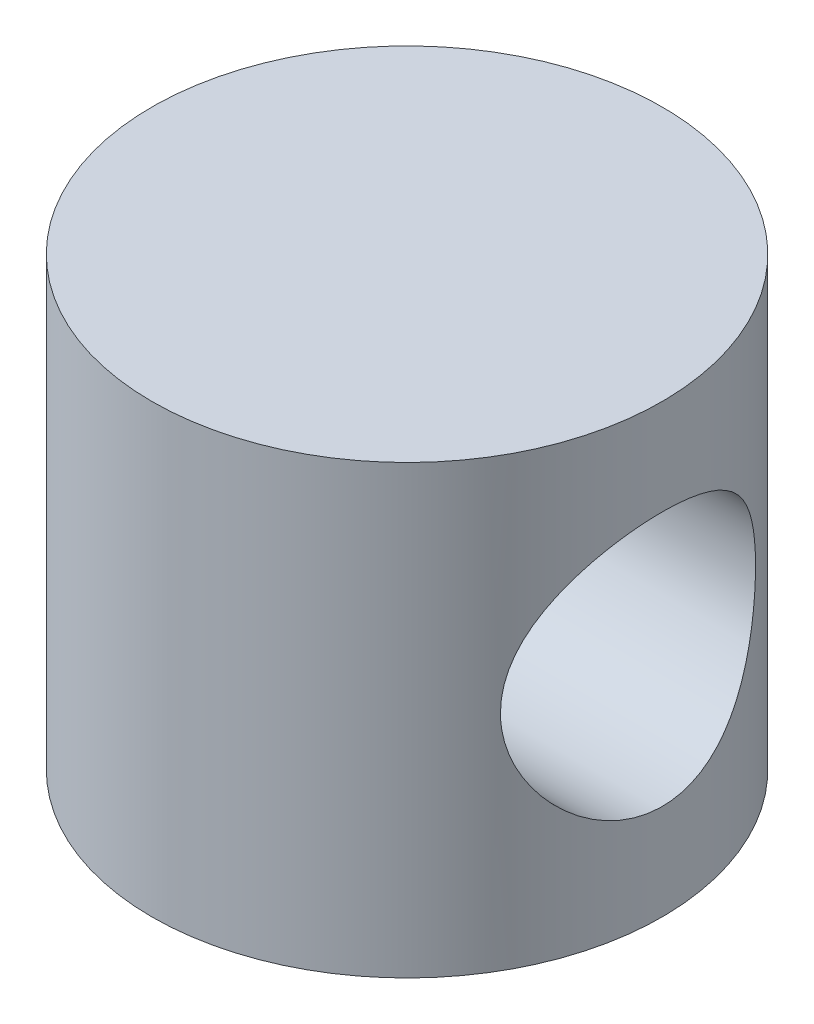
ISO-10303-21;
HEADER;
FILE_DESCRIPTION(('STEP AP214'),'2;1');
FILE_NAME('part.step','',(''),(''),'','','');
FILE_SCHEMA(('AUTOMOTIVE_DESIGN { 1 0 10303 214 1 1 1 1 }'));
ENDSEC;
DATA;
#1=APPLICATION_CONTEXT('core data for automotive mechanical design processes');
#2=APPLICATION_PROTOCOL_DEFINITION('international standard','automotive_design',2000,#1);
#3=PRODUCT_CONTEXT('',#1,'mechanical');
#4=PRODUCT('Part','Part','',(#3));
#5=PRODUCT_RELATED_PRODUCT_CATEGORY('part','',(#4));
#6=PRODUCT_DEFINITION_FORMATION('','',#4);
#7=PRODUCT_DEFINITION_CONTEXT('part definition',#1,'design');
#8=PRODUCT_DEFINITION('design','',#6,#7);
#9=PRODUCT_DEFINITION_SHAPE('','',#8);
#10=(LENGTH_UNIT() NAMED_UNIT(*) SI_UNIT(.MILLI.,.METRE.));
#11=(NAMED_UNIT(*) PLANE_ANGLE_UNIT() SI_UNIT($,.RADIAN.));
#12=(NAMED_UNIT(*) SI_UNIT($,.STERADIAN.) SOLID_ANGLE_UNIT());
#13=UNCERTAINTY_MEASURE_WITH_UNIT(LENGTH_MEASURE(1.E-05),#10,'distance_accuracy_value','');
#14=(GEOMETRIC_REPRESENTATION_CONTEXT(3) GLOBAL_UNCERTAINTY_ASSIGNED_CONTEXT((#13)) GLOBAL_UNIT_ASSIGNED_CONTEXT((#10,
#11,#12)) REPRESENTATION_CONTEXT('',''));
#15=CARTESIAN_POINT('',(0.,0.,0.));
#16=DIRECTION('',(0.,0.,1.));
#17=DIRECTION('',(1.,0.,0.));
#18=AXIS2_PLACEMENT_3D('',#15,#16,#17);
#19=CARTESIAN_POINT('',(0.,14.,0.));
#20=DIRECTION('',(0.,-1.,0.));
#21=DIRECTION('',(0.,0.,-1.));
#22=AXIS2_PLACEMENT_3D('',#19,#20,#21);
#23=CYLINDRICAL_SURFACE('',#22,8.);
#24=CARTESIAN_POINT('',(6.92820323027551,7.,4.));
#25=CARTESIAN_POINT('',(6.92820386262827,7.1042653254373,3.99999950219345));
#26=CARTESIAN_POINT('',(6.93056511456489,7.20853992667939,3.9959176319954));
#27=CARTESIAN_POINT('',(6.93992172463862,7.41628417460038,3.97964472112407));
#28=CARTESIAN_POINT('',(6.94691924018481,7.51975342383269,3.96744990521398));
#29=CARTESIAN_POINT('',(6.96530330045203,7.72521084556988,3.93508538297522));
#30=CARTESIAN_POINT('',(6.97669672816262,7.82719643382953,3.91490316893164));
#31=CARTESIAN_POINT('',(7.00345973447504,8.02881400167829,3.86682062971258));
#32=CARTESIAN_POINT('',(7.01883104071991,8.12844493804268,3.83891695064122));
#33=CARTESIAN_POINT('',(7.06996541785761,8.42168896600919,3.74442772916635));
#34=CARTESIAN_POINT('',(7.11087904783325,8.61098585661697,3.66684915651285));
#35=CARTESIAN_POINT('',(7.20170927952068,8.97372956380103,3.48506075380109));
#36=CARTESIAN_POINT('',(7.25162636823861,9.14717552221941,3.38084948302616));
#37=CARTESIAN_POINT('',(7.3598722626408,9.48920849434794,3.13867639492105));
#38=CARTESIAN_POINT('',(7.41855528289904,9.65621486644762,2.99863981046008));
#39=CARTESIAN_POINT('',(7.53488657765781,9.96565524064935,2.69298354883075));
#40=CARTESIAN_POINT('',(7.59253432325009,10.1080769857639,2.52735118809493));
#41=CARTESIAN_POINT('',(7.6758759355965,10.3049820664822,2.25626437810992));
#42=CARTESIAN_POINT('',(7.70394919240219,10.3695322616191,2.15870290429515));
#43=CARTESIAN_POINT('',(7.75744193796062,10.4901044402281,1.95777427065882));
#44=CARTESIAN_POINT('',(7.78286255243594,10.5461300460092,1.85440960246323));
#45=CARTESIAN_POINT('',(7.83032159918279,10.6491127816576,1.64251485422606));
#46=CARTESIAN_POINT('',(7.85236008406492,10.6960700525899,1.53398485456801));
#47=CARTESIAN_POINT('',(7.89238619731919,10.7803619482657,1.31258580967489));
#48=CARTESIAN_POINT('',(7.91037610439248,10.8177019876893,1.19971924732415));
#49=CARTESIAN_POINT('',(7.94064573590697,10.8800182942747,0.97862257568324));
#50=CARTESIAN_POINT('',(7.95323930006917,10.9056821530584,0.870629018183688));
#51=CARTESIAN_POINT('',(7.97409583861317,10.9479797074335,0.65252408843572));
#52=CARTESIAN_POINT('',(7.98236093189932,10.9646178215157,0.542413779814408));
#53=CARTESIAN_POINT('',(7.99432715952591,10.9886558669975,0.320973525125334));
#54=CARTESIAN_POINT('',(7.99802960221736,10.9960584467161,0.209643937931225));
#55=CARTESIAN_POINT('',(8.0007656004484,11.00153168637,-0.0132971447801755));
#56=CARTESIAN_POINT('',(7.99979944163708,10.9996029172451,-0.124908622632317));
#57=CARTESIAN_POINT('',(7.99351360464185,10.9870147912927,-0.337727985342425));
#58=CARTESIAN_POINT('',(7.98858118408677,10.9771319776509,-0.438993817716941));
#59=CARTESIAN_POINT('',(7.97497880011988,10.9497367209039,-0.640243249291356));
#60=CARTESIAN_POINT('',(7.96630763313356,10.9322218208639,-0.740226424897068));
#61=CARTESIAN_POINT('',(7.93497195498556,10.8684894773056,-1.03714138295469));
#62=CARTESIAN_POINT('',(7.9069787607081,10.8110721029989,-1.23123936013571));
#63=CARTESIAN_POINT('',(7.83886272517952,10.6676660261144,-1.6092687156014));
#64=CARTESIAN_POINT('',(7.79857742343273,10.5812930175966,-1.79302228049015));
#65=CARTESIAN_POINT('',(7.70950607728793,10.3829480655292,-2.14389861654609));
#66=CARTESIAN_POINT('',(7.66071699099023,10.2709669571856,-2.31101540282593));
#67=CARTESIAN_POINT('',(7.55377539869557,10.0124150800027,-2.64069813790285));
#68=CARTESIAN_POINT('',(7.49517374441381,9.86357523984661,-2.80134064782814));
#69=CARTESIAN_POINT('',(7.37817491997774,9.54165375681343,-3.096413130151));
#70=CARTESIAN_POINT('',(7.31977794078032,9.36855363717567,-3.23082293513643));
#71=CARTESIAN_POINT('',(7.20576112808083,8.98935711133187,-3.47803613314164));
#72=CARTESIAN_POINT('',(7.15055315383099,8.78186338145237,-3.58892539602578));
#73=CARTESIAN_POINT('',(7.07886925416583,8.45658261556122,-3.72723782010755));
#74=CARTESIAN_POINT('',(7.05682593849463,8.34579164080265,-3.76867730715226));
#75=CARTESIAN_POINT('',(7.01731299636541,8.12025515321878,-3.84175062064907));
#76=CARTESIAN_POINT('',(6.99984055082837,8.00551212747386,-3.873390493228));
#77=CARTESIAN_POINT('',(6.97140602598866,7.78217133548264,-3.92431909326377));
#78=CARTESIAN_POINT('',(6.96003957007804,7.67380134853994,-3.94438433855719));
#79=CARTESIAN_POINT('',(6.94230335544128,7.45541909952216,-3.97551851361913));
#80=CARTESIAN_POINT('',(6.93593099829036,7.34540772186559,-3.98659212183614));
#81=CARTESIAN_POINT('',(6.92844811909924,7.12470748996731,-3.99958291311109));
#82=CARTESIAN_POINT('',(6.92733563775175,7.01401890337321,-4.00150350567568));
#83=CARTESIAN_POINT('',(6.93041539174955,6.79294330689436,-3.99616718095745));
#84=CARTESIAN_POINT('',(6.93460726902938,6.68255627715738,-3.9889108831515));
#85=CARTESIAN_POINT('',(6.94737197203376,6.47513061602036,-3.96663154579715));
#86=CARTESIAN_POINT('',(6.95541341326252,6.37795678898769,-3.95254845698989));
#87=CARTESIAN_POINT('',(6.97528372672039,6.18526806656622,-3.91737385475212));
#88=CARTESIAN_POINT('',(6.98711384958699,6.08975372996381,-3.89628002700135));
#89=CARTESIAN_POINT('',(7.02775685901555,5.80663196389193,-3.82280238446313));
#90=CARTESIAN_POINT('',(7.06173163693377,5.62230856572734,-3.76020731695078));
#91=CARTESIAN_POINT('',(7.1414499329204,5.25832541229841,-3.60658595732555));
#92=CARTESIAN_POINT('',(7.18766564346825,5.07927704666103,-3.51437713951607));
#93=CARTESIAN_POINT('',(7.28624486618865,4.73812980331288,-3.30514737086267));
#94=CARTESIAN_POINT('',(7.33861153030439,4.57603969669191,-3.18811367399408));
#95=CARTESIAN_POINT('',(7.45151836616993,4.25208687714179,-2.91535761342628));
#96=CARTESIAN_POINT('',(7.51225675092662,4.0928284128341,-2.7566180003781));
#97=CARTESIAN_POINT('',(7.62937597657745,3.80233402658416,-2.41358105803055));
#98=CARTESIAN_POINT('',(7.68575534144675,3.67110757038376,-2.22927513013699));
#99=CARTESIAN_POINT('',(7.76335543938379,3.49679221776281,-1.93419225408146));
#100=CARTESIAN_POINT('',(7.78834354202674,3.44186994270129,-1.83122945254024));
#101=CARTESIAN_POINT('',(7.83494183925331,3.34099446912297,-1.62028527572799));
#102=CARTESIAN_POINT('',(7.85655355213899,3.29503723686177,-1.51230618469744));
#103=CARTESIAN_POINT('',(7.89575152015211,3.21262567335987,-1.29213403393068));
#104=CARTESIAN_POINT('',(7.91333968113673,3.17616684182038,-1.17994299872755));
#105=CARTESIAN_POINT('',(7.94396070933363,3.11319273905408,-0.952197786601983));
#106=CARTESIAN_POINT('',(7.95699411670659,3.08667628870593,-0.836644010238128));
#107=CARTESIAN_POINT('',(7.97711749125789,3.04592795005278,-0.613942900584696));
#108=CARTESIAN_POINT('',(7.98464383966398,3.03079052722419,-0.506999857370268));
#109=CARTESIAN_POINT('',(7.99539449729097,3.00920788664752,-0.291983714868725));
#110=CARTESIAN_POINT('',(7.99861737381754,3.00276556362899,-0.183910251308578));
#111=CARTESIAN_POINT('',(8.00066496370437,2.9986698579145,0.0323692027916287));
#112=CARTESIAN_POINT('',(7.99949272302419,3.00101038841558,0.140575049615287));
#113=CARTESIAN_POINT('',(7.99278884324615,3.01443767082597,0.356345776551111));
#114=CARTESIAN_POINT('',(7.9872556066098,3.02552762786376,0.463910407218418));
#115=CARTESIAN_POINT('',(7.97248705040341,3.05529397739044,0.670402230454413));
#116=CARTESIAN_POINT('',(7.96352188946078,3.0734178487041,0.769428771379721));
#117=CARTESIAN_POINT('',(7.94213883037982,3.11696993748829,0.965494016558231));
#118=CARTESIAN_POINT('',(7.92971975328176,3.14240064917404,1.06253202988244));
#119=CARTESIAN_POINT('',(7.88769036296796,3.22928659575067,1.34967669515381));
#120=CARTESIAN_POINT('',(7.85329454083082,3.30136154016002,1.535990515319));
#121=CARTESIAN_POINT('',(7.77303546188782,3.47491377728062,1.90172389087137));
#122=CARTESIAN_POINT('',(7.72674465907378,3.57751677233395,2.08050775123498));
#123=CARTESIAN_POINT('',(7.62752535456451,3.80783224417312,2.41909138351715));
#124=CARTESIAN_POINT('',(7.57459380826236,3.93555625363244,2.57888238184508));
#125=CARTESIAN_POINT('',(7.46114622775076,4.22718013687798,2.8916543099683));
#126=CARTESIAN_POINT('',(7.40039963213063,4.39341522683605,3.04237488708293));
#127=CARTESIAN_POINT('',(7.28251536809497,4.74983763817227,3.31466901461284));
#128=CARTESIAN_POINT('',(7.22538092516391,4.94004592524942,3.43621677845464));
#129=CARTESIAN_POINT('',(7.14673032771598,5.24337573615295,3.59554085555899));
#130=CARTESIAN_POINT('',(7.12134958638074,5.34930106826833,3.64540546855455));
#131=CARTESIAN_POINT('',(7.07430377646636,5.56580437696515,3.7358834166029));
#132=CARTESIAN_POINT('',(7.05263679540785,5.6763799220619,3.77650151690077));
#133=CARTESIAN_POINT('',(7.01393620687008,5.90112629943263,3.8479016704483));
#134=CARTESIAN_POINT('',(6.99689069691894,6.01528703446802,3.87870902746065));
#135=CARTESIAN_POINT('',(6.96811827819219,6.24647371557682,3.93016568856618));
#136=CARTESIAN_POINT('',(6.95638765128934,6.36349759808763,3.95082209480824));
#137=CARTESIAN_POINT('',(6.94118032889089,6.56719830954344,3.97745846425997));
#138=CARTESIAN_POINT('',(6.93632575562014,6.6534593729815,3.98590343866333));
#139=CARTESIAN_POINT('',(6.92983683549392,6.82647812798563,3.99717460159988));
#140=CARTESIAN_POINT('',(6.92820270406464,6.91323585238573,4.00000041424856));
#141=CARTESIAN_POINT('',(6.92820323027551,7.,4.));
#142=B_SPLINE_CURVE_WITH_KNOTS('',3,(#24,#25,#26,#27,#28,#29,#30,#31,#32,#33,#34,#35,#36,#37,
#38,#39,#40,#41,#42,#43,#44,#45,#46,#47,#48,#49,#50,#51,#52,#53,#54,#55,#56,#57,#58,#59,#60,#61,
#62,#63,#64,#65,#66,#67,#68,#69,#70,#71,#72,#73,#74,#75,#76,#77,#78,#79,#80,#81,#82,#83,#84,#85,
#86,#87,#88,#89,#90,#91,#92,#93,#94,#95,#96,#97,#98,#99,#100,#101,#102,#103,#104,#105,#106,#107,
#108,#109,#110,#111,#112,#113,#114,#115,#116,#117,#118,#119,#120,#121,#122,#123,#124,#125,#126,
#127,#128,#129,#130,#131,#132,#133,#134,#135,#136,#137,#138,#139,#140,#141),.UNSPECIFIED.,.T.,
.F.,(4,2,2,2,2,2,2,2,2,2,2,2,2,2,2,2,2,2,2,2,2,2,2,2,2,2,2,2,2,2,2,2,2,2,2,2,2,2,2,2,2,2,2,2,2,
2,2,2,2,2,2,2,2,2,2,2,2,2,4),(0.,0.312705907645188,0.625557430139017,0.938900807369692,
1.25238050266336,1.87532331508721,2.49829983322607,3.17265818143841,3.84735177482031,
4.20786878872691,4.568232179613,4.92858996431118,5.28874441516656,5.62343001077676,
5.95795161516748,6.29237727234833,6.62678246790365,6.93200651230821,7.23732888766059,
7.84737748897726,8.46586637752492,9.08457696228993,9.76177264655468,10.4394869181158,
11.160238657457,11.5207615871968,11.8810616378014,12.212984058814,12.5447336660446,
12.8763596865808,13.2079633222266,13.5031682056198,13.7984706362685,14.38866539675,
15.006195155551,15.6240427481094,16.319773042532,17.0157378984356,17.3733524504477,
17.7308057238246,18.0880893282017,18.4453305469501,18.7697157004162,19.0942088199644,
19.4184770967801,19.7428642161659,20.0457160884446,20.3486714633268,20.9540518089476,
21.585324497246,22.2168876724958,22.9113041424698,23.6063321822732,23.9652997079033,
24.3240818165632,24.6819309195696,25.0395292944428,25.2997293817866,25.5599468741983),.UNSPECIFIED.);
#143=CARTESIAN_POINT('',(6.92820323027551,7.,4.));
#144=VERTEX_POINT('',#143);
#145=EDGE_CURVE('E36',#144,#144,#142,.T.);
#146=ORIENTED_EDGE('',*,*,#145,.T.);
#147=EDGE_LOOP('',(#146));
#148=FACE_BOUND('',#147,.T.);
#149=CARTESIAN_POINT('',(-6.92820323027551,7.,4.));
#150=CARTESIAN_POINT('',(-6.92820386262827,6.8957346745627,3.99999950219345));
#151=CARTESIAN_POINT('',(-6.93056511456489,6.79146007332061,3.9959176319954));
#152=CARTESIAN_POINT('',(-6.93992172463862,6.58371582539962,3.97964472112407));
#153=CARTESIAN_POINT('',(-6.94691924018481,6.48024657616731,3.96744990521398));
#154=CARTESIAN_POINT('',(-6.96530330045203,6.27478915443012,3.93508538297522));
#155=CARTESIAN_POINT('',(-6.97669672816263,6.17280356617047,3.91490316893164));
#156=CARTESIAN_POINT('',(-7.00345973447504,5.97118599832171,3.86682062971258));
#157=CARTESIAN_POINT('',(-7.01883104071991,5.87155506195732,3.83891695064122));
#158=CARTESIAN_POINT('',(-7.06996541785761,5.57831103399081,3.74442772916634));
#159=CARTESIAN_POINT('',(-7.11087904783325,5.38901414338303,3.66684915651285));
#160=CARTESIAN_POINT('',(-7.20170927952068,5.02627043619896,3.48506075380109));
#161=CARTESIAN_POINT('',(-7.25162636823861,4.85282447778058,3.38084948302616));
#162=CARTESIAN_POINT('',(-7.35987226264081,4.51079150565205,3.13867639492104));
#163=CARTESIAN_POINT('',(-7.41855528289904,4.34378513355238,2.99863981046008));
#164=CARTESIAN_POINT('',(-7.53488657765781,4.03434475935065,2.69298354883075));
#165=CARTESIAN_POINT('',(-7.59253432325009,3.89192301423607,2.52735118809493));
#166=CARTESIAN_POINT('',(-7.6758759355965,3.69501793351785,2.25626437810991));
#167=CARTESIAN_POINT('',(-7.70394919240219,3.63046773838086,2.15870290429515));
#168=CARTESIAN_POINT('',(-7.75744193796062,3.50989555977189,1.95777427065882));
#169=CARTESIAN_POINT('',(-7.78286255243594,3.45386995399076,1.85440960246323));
#170=CARTESIAN_POINT('',(-7.83032159918279,3.35088721834241,1.64251485422606));
#171=CARTESIAN_POINT('',(-7.85236008406492,3.3039299474101,1.53398485456801));
#172=CARTESIAN_POINT('',(-7.89238619731919,3.21963805173427,1.31258580967489));
#173=CARTESIAN_POINT('',(-7.91037610439248,3.18229801231068,1.19971924732415));
#174=CARTESIAN_POINT('',(-7.94064573590697,3.11998170572534,0.978622575683238));
#175=CARTESIAN_POINT('',(-7.95323930006917,3.09431784694156,0.870629018183686));
#176=CARTESIAN_POINT('',(-7.97409583861317,3.05202029256653,0.652524088435718));
#177=CARTESIAN_POINT('',(-7.98236093189932,3.03538217848427,0.542413779814407));
#178=CARTESIAN_POINT('',(-7.99432715952591,3.01134413300253,0.320973525125332));
#179=CARTESIAN_POINT('',(-7.99802960221736,3.00394155328386,0.209643937931223));
#180=CARTESIAN_POINT('',(-8.0007656004484,2.99846831363001,-0.0132971447801773));
#181=CARTESIAN_POINT('',(-7.99979944163708,3.00039708275485,-0.124908622632318));
#182=CARTESIAN_POINT('',(-7.99351360464185,3.01298520870727,-0.337727985342427));
#183=CARTESIAN_POINT('',(-7.98858118408677,3.02286802234914,-0.438993817716942));
#184=CARTESIAN_POINT('',(-7.97497880011988,3.05026327909606,-0.640243249291357));
#185=CARTESIAN_POINT('',(-7.96630763313356,3.06777817913607,-0.740226424897069));
#186=CARTESIAN_POINT('',(-7.93497195498556,3.13151052269444,-1.03714138295469));
#187=CARTESIAN_POINT('',(-7.9069787607081,3.18892789700107,-1.23123936013571));
#188=CARTESIAN_POINT('',(-7.83886272517952,3.3323339738856,-1.60926871560141));
#189=CARTESIAN_POINT('',(-7.79857742343273,3.41870698240342,-1.79302228049015));
#190=CARTESIAN_POINT('',(-7.70950607728793,3.61705193447081,-2.14389861654609));
#191=CARTESIAN_POINT('',(-7.66071699099023,3.72903304281444,-2.31101540282593));
#192=CARTESIAN_POINT('',(-7.55377539869557,3.98758491999729,-2.64069813790285));
#193=CARTESIAN_POINT('',(-7.49517374441381,4.13642476015339,-2.80134064782814));
#194=CARTESIAN_POINT('',(-7.37817491997774,4.45834624318657,-3.096413130151));
#195=CARTESIAN_POINT('',(-7.31977794078032,4.63144636282433,-3.23082293513643));
#196=CARTESIAN_POINT('',(-7.20576112808082,5.01064288866813,-3.47803613314164));
#197=CARTESIAN_POINT('',(-7.15055315383099,5.21813661854764,-3.58892539602578));
#198=CARTESIAN_POINT('',(-7.07886925416583,5.54341738443877,-3.72723782010755));
#199=CARTESIAN_POINT('',(-7.05682593849463,5.65420835919735,-3.76867730715226));
#200=CARTESIAN_POINT('',(-7.01731299636541,5.87974484678122,-3.84175062064907));
#201=CARTESIAN_POINT('',(-6.99984055082837,5.99448787252614,-3.873390493228));
#202=CARTESIAN_POINT('',(-6.97140602598866,6.21782866451736,-3.92431909326377));
#203=CARTESIAN_POINT('',(-6.96003957007804,6.32619865146006,-3.94438433855719));
#204=CARTESIAN_POINT('',(-6.94230335544128,6.54458090047784,-3.97551851361913));
#205=CARTESIAN_POINT('',(-6.93593099829036,6.65459227813442,-3.98659212183614));
#206=CARTESIAN_POINT('',(-6.92844811909924,6.8752925100327,-3.99958291311109));
#207=CARTESIAN_POINT('',(-6.92733563775175,6.98598109662679,-4.00150350567568));
#208=CARTESIAN_POINT('',(-6.93041539174955,7.20705669310565,-3.99616718095745));
#209=CARTESIAN_POINT('',(-6.93460726902938,7.31744372284262,-3.98891088315149));
#210=CARTESIAN_POINT('',(-6.94737197203376,7.52486938397965,-3.96663154579715));
#211=CARTESIAN_POINT('',(-6.95541341326252,7.62204321101231,-3.95254845698989));
#212=CARTESIAN_POINT('',(-6.97528372672039,7.81473193343378,-3.91737385475212));
#213=CARTESIAN_POINT('',(-6.98711384958699,7.9102462700362,-3.89628002700135));
#214=CARTESIAN_POINT('',(-7.02775685901555,8.19336803610807,-3.82280238446313));
#215=CARTESIAN_POINT('',(-7.06173163693377,8.37769143427267,-3.76020731695078));
#216=CARTESIAN_POINT('',(-7.14144993292041,8.7416745877016,-3.60658595732554));
#217=CARTESIAN_POINT('',(-7.18766564346826,8.92072295333897,-3.51437713951607));
#218=CARTESIAN_POINT('',(-7.28624486618865,9.26187019668712,-3.30514737086267));
#219=CARTESIAN_POINT('',(-7.33861153030439,9.42396030330809,-3.18811367399408));
#220=CARTESIAN_POINT('',(-7.45151836616993,9.74791312285821,-2.91535761342628));
#221=CARTESIAN_POINT('',(-7.51225675092662,9.9071715871659,-2.7566180003781));
#222=CARTESIAN_POINT('',(-7.62937597657745,10.1976659734158,-2.41358105803055));
#223=CARTESIAN_POINT('',(-7.68575534144675,10.3288924296162,-2.22927513013699));
#224=CARTESIAN_POINT('',(-7.76335543938379,10.5032077822372,-1.93419225408146));
#225=CARTESIAN_POINT('',(-7.78834354202674,10.5581300572987,-1.83122945254024));
#226=CARTESIAN_POINT('',(-7.83494183925332,10.659005530877,-1.62028527572799));
#227=CARTESIAN_POINT('',(-7.85655355213899,10.7049627631382,-1.51230618469744));
#228=CARTESIAN_POINT('',(-7.89575152015211,10.7873743266401,-1.29213403393068));
#229=CARTESIAN_POINT('',(-7.91333968113673,10.8238331581796,-1.17994299872755));
#230=CARTESIAN_POINT('',(-7.94396070933363,10.8868072609459,-0.952197786601984));
#231=CARTESIAN_POINT('',(-7.95699411670659,10.9133237112941,-0.836644010238128));
#232=CARTESIAN_POINT('',(-7.97711749125789,10.9540720499472,-0.613942900584695));
#233=CARTESIAN_POINT('',(-7.98464383966398,10.9692094727758,-0.506999857370267));
#234=CARTESIAN_POINT('',(-7.99539449729097,10.9907921133525,-0.291983714868724));
#235=CARTESIAN_POINT('',(-7.99861737381754,10.997234436371,-0.183910251308577));
#236=CARTESIAN_POINT('',(-8.00066496370437,11.0013301420855,0.0323692027916299));
#237=CARTESIAN_POINT('',(-7.99949272302419,10.9989896115844,0.140575049615289));
#238=CARTESIAN_POINT('',(-7.99278884324615,10.985562329174,0.356345776551113));
#239=CARTESIAN_POINT('',(-7.9872556066098,10.9744723721362,0.46391040721842));
#240=CARTESIAN_POINT('',(-7.97248705040341,10.9447060226096,0.670402230454414));
#241=CARTESIAN_POINT('',(-7.96352188946078,10.9265821512959,0.76942877137972));
#242=CARTESIAN_POINT('',(-7.94213883037982,10.8830300625117,0.96549401655823));
#243=CARTESIAN_POINT('',(-7.92971975328176,10.857599350826,1.06253202988244));
#244=CARTESIAN_POINT('',(-7.88769036296796,10.7707134042493,1.34967669515382));
#245=CARTESIAN_POINT('',(-7.85329454083082,10.69863845984,1.535990515319));
#246=CARTESIAN_POINT('',(-7.77303546188782,10.5250862227194,1.90172389087137));
#247=CARTESIAN_POINT('',(-7.72674465907378,10.4224832276661,2.08050775123498));
#248=CARTESIAN_POINT('',(-7.62752535456451,10.1921677558269,2.41909138351715));
#249=CARTESIAN_POINT('',(-7.57459380826236,10.0644437463676,2.57888238184509));
#250=CARTESIAN_POINT('',(-7.46114622775076,9.77281986312202,2.8916543099683));
#251=CARTESIAN_POINT('',(-7.40039963213063,9.60658477316395,3.04237488708293));
#252=CARTESIAN_POINT('',(-7.28251536809497,9.25016236182773,3.31466901461284));
#253=CARTESIAN_POINT('',(-7.22538092516391,9.05995407475058,3.43621677845464));
#254=CARTESIAN_POINT('',(-7.14673032771598,8.75662426384705,3.59554085555899));
#255=CARTESIAN_POINT('',(-7.12134958638074,8.65069893173167,3.64540546855455));
#256=CARTESIAN_POINT('',(-7.07430377646636,8.43419562303485,3.7358834166029));
#257=CARTESIAN_POINT('',(-7.05263679540785,8.3236200779381,3.77650151690077));
#258=CARTESIAN_POINT('',(-7.01393620687008,8.09887370056737,3.8479016704483));
#259=CARTESIAN_POINT('',(-6.99689069691894,7.98471296553198,3.87870902746065));
#260=CARTESIAN_POINT('',(-6.96811827819219,7.75352628442318,3.93016568856618));
#261=CARTESIAN_POINT('',(-6.95638765128934,7.63650240191237,3.95082209480824));
#262=CARTESIAN_POINT('',(-6.94118032889089,7.43280169045656,3.97745846425997));
#263=CARTESIAN_POINT('',(-6.93632575562014,7.3465406270185,3.98590343866333));
#264=CARTESIAN_POINT('',(-6.92983683549392,7.17352187201437,3.99717460159988));
#265=CARTESIAN_POINT('',(-6.92820270406464,7.08676414761428,4.00000041424856));
#266=CARTESIAN_POINT('',(-6.92820323027551,7.,4.));
#267=B_SPLINE_CURVE_WITH_KNOTS('',3,(#149,#150,#151,#152,#153,#154,#155,#156,#157,#158,#159,
#160,#161,#162,#163,#164,#165,#166,#167,#168,#169,#170,#171,#172,#173,#174,#175,#176,#177,#178,
#179,#180,#181,#182,#183,#184,#185,#186,#187,#188,#189,#190,#191,#192,#193,#194,#195,#196,#197,
#198,#199,#200,#201,#202,#203,#204,#205,#206,#207,#208,#209,#210,#211,#212,#213,#214,#215,#216,
#217,#218,#219,#220,#221,#222,#223,#224,#225,#226,#227,#228,#229,#230,#231,#232,#233,#234,#235,
#236,#237,#238,#239,#240,#241,#242,#243,#244,#245,#246,#247,#248,#249,#250,#251,#252,#253,#254,
#255,#256,#257,#258,#259,#260,#261,#262,#263,#264,#265,#266),.UNSPECIFIED.,.T.,.F.,(4,2,2,2,2,2,
2,2,2,2,2,2,2,2,2,2,2,2,2,2,2,2,2,2,2,2,2,2,2,2,2,2,2,2,2,2,2,2,2,2,2,2,2,2,2,2,2,2,2,2,2,2,2,2,
2,2,2,2,4),(0.,0.312705907645188,0.625557430139017,0.938900807369693,1.25238050266336,
1.87532331508721,2.49829983322607,3.17265818143841,3.84735177482031,4.20786878872692,
4.568232179613,4.92858996431119,5.28874441516656,5.62343001077676,5.95795161516748,
6.29237727234833,6.62678246790366,6.93200651230821,7.23732888766059,7.84737748897727,
8.46586637752493,9.08457696228993,9.76177264655469,10.4394869181158,11.160238657457,
11.5207615871968,11.8810616378014,12.212984058814,12.5447336660446,12.8763596865808,
13.2079633222266,13.5031682056198,13.7984706362685,14.38866539675,15.006195155551,
15.6240427481094,16.319773042532,17.0157378984356,17.3733524504477,17.7308057238246,
18.0880893282017,18.4453305469501,18.7697157004162,19.0942088199644,19.4184770967801,
19.7428642161659,20.0457160884446,20.3486714633268,20.9540518089476,21.585324497246,
22.2168876724958,22.9113041424698,23.6063321822732,23.9652997079033,24.3240818165632,
24.6819309195696,25.0395292944428,25.2997293817866,25.5599468741983),.UNSPECIFIED.);
#268=CARTESIAN_POINT('',(-6.92820323027551,7.,4.));
#269=VERTEX_POINT('',#268);
#270=EDGE_CURVE('E10',#269,#269,#267,.T.);
#271=ORIENTED_EDGE('',*,*,#270,.T.);
#272=EDGE_LOOP('',(#271));
#273=FACE_BOUND('',#272,.T.);
#274=CARTESIAN_POINT('',(0.,14.,0.));
#275=DIRECTION('',(0.,1.,0.));
#276=DIRECTION('',(0.,0.,1.));
#277=AXIS2_PLACEMENT_3D('',#274,#275,#276);
#278=CIRCLE('',#277,8.);
#279=CARTESIAN_POINT('',(0.,14.,8.));
#280=VERTEX_POINT('',#279);
#281=EDGE_CURVE('E44',#280,#280,#278,.T.);
#282=ORIENTED_EDGE('',*,*,#281,.F.);
#283=EDGE_LOOP('',(#282));
#284=FACE_BOUND('',#283,.T.);
#285=CARTESIAN_POINT('',(0.,0.,0.));
#286=DIRECTION('',(0.,1.,0.));
#287=DIRECTION('',(0.,0.,1.));
#288=AXIS2_PLACEMENT_3D('',#285,#286,#287);
#289=CIRCLE('',#288,8.);
#290=CARTESIAN_POINT('',(0.,0.,8.));
#291=VERTEX_POINT('',#290);
#292=EDGE_CURVE('E48',#291,#291,#289,.T.);
#293=ORIENTED_EDGE('',*,*,#292,.T.);
#294=EDGE_LOOP('',(#293));
#295=FACE_BOUND('',#294,.T.);
#296=ADVANCED_FACE('F32',(#148,#273,#284,#295),#23,.T.);
#297=CARTESIAN_POINT('',(0.,0.,0.));
#298=DIRECTION('',(0.,1.,0.));
#299=DIRECTION('',(0.,0.,1.));
#300=AXIS2_PLACEMENT_3D('',#297,#298,#299);
#301=PLANE('',#300);
#302=ORIENTED_EDGE('',*,*,#292,.F.);
#303=EDGE_LOOP('',(#302));
#304=FACE_BOUND('',#303,.T.);
#305=ADVANCED_FACE('F59',(#304),#301,.F.);
#306=CARTESIAN_POINT('',(21.,7.,0.));
#307=DIRECTION('',(-1.,0.,0.));
#308=DIRECTION('',(0.,0.,1.));
#309=AXIS2_PLACEMENT_3D('',#306,#307,#308);
#310=CYLINDRICAL_SURFACE('',#309,4.);
#311=ORIENTED_EDGE('',*,*,#270,.F.);
#312=EDGE_LOOP('',(#311));
#313=FACE_BOUND('',#312,.T.);
#314=ORIENTED_EDGE('',*,*,#145,.F.);
#315=EDGE_LOOP('',(#314));
#316=FACE_BOUND('',#315,.T.);
#317=ADVANCED_FACE('F54',(#313,#316),#310,.F.);
#318=CARTESIAN_POINT('',(21.,14.,8.53489592927303));
#319=DIRECTION('',(0.,-1.,0.));
#320=DIRECTION('',(0.,0.,-1.));
#321=AXIS2_PLACEMENT_3D('',#318,#319,#320);
#322=PLANE('',#321);
#323=ORIENTED_EDGE('',*,*,#281,.T.);
#324=EDGE_LOOP('',(#323));
#325=FACE_BOUND('',#324,.T.);
#326=ADVANCED_FACE('F58',(#325),#322,.F.);
#327=CLOSED_SHELL('',(#296,#305,#317,#326));
#328=MANIFOLD_SOLID_BREP('B2',#327);
#329=ADVANCED_BREP_SHAPE_REPRESENTATION('',(#18,#328),#14);
#330=SHAPE_DEFINITION_REPRESENTATION(#9,#329);
ENDSEC;
END-ISO-10303-21;
